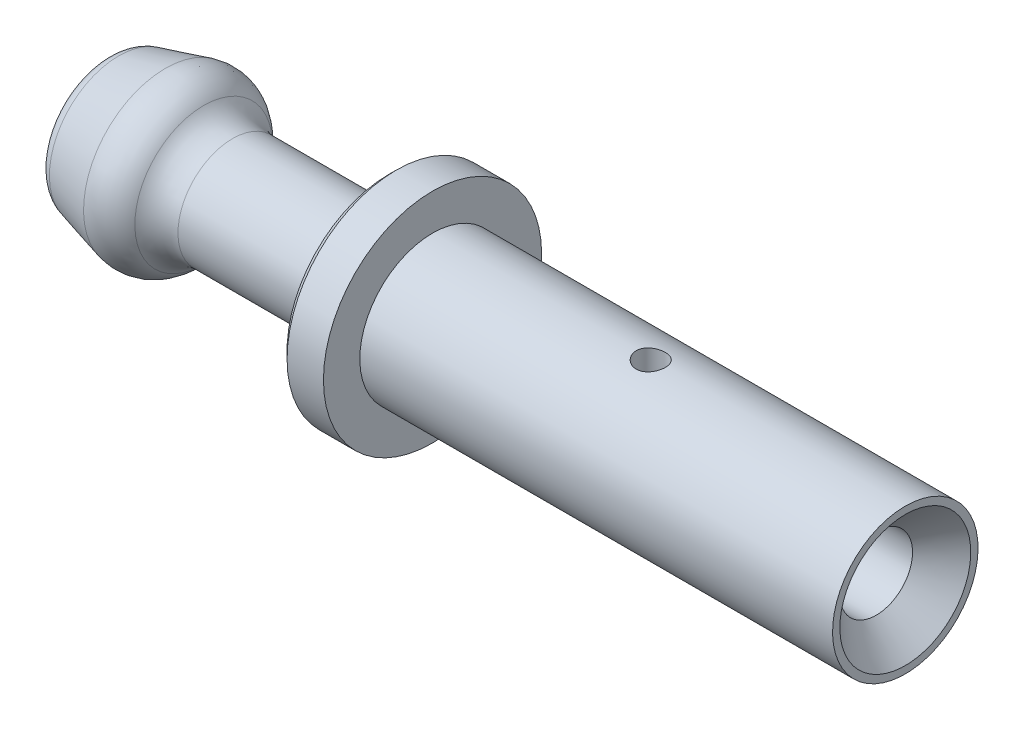
ISO-10303-21;
HEADER;
FILE_DESCRIPTION(('STEP AP214'),'2;1');
FILE_NAME('part.step','',(''),(''),'','','');
FILE_SCHEMA(('AUTOMOTIVE_DESIGN { 1 0 10303 214 1 1 1 1 }'));
ENDSEC;
DATA;
#1=APPLICATION_CONTEXT('core data for automotive mechanical design processes');
#2=APPLICATION_PROTOCOL_DEFINITION('international standard','automotive_design',2000,#1);
#3=PRODUCT_CONTEXT('',#1,'mechanical');
#4=PRODUCT('Part','Part','',(#3));
#5=PRODUCT_RELATED_PRODUCT_CATEGORY('part','',(#4));
#6=PRODUCT_DEFINITION_FORMATION('','',#4);
#7=PRODUCT_DEFINITION_CONTEXT('part definition',#1,'design');
#8=PRODUCT_DEFINITION('design','',#6,#7);
#9=PRODUCT_DEFINITION_SHAPE('','',#8);
#10=(LENGTH_UNIT() NAMED_UNIT(*) SI_UNIT(.MILLI.,.METRE.));
#11=(NAMED_UNIT(*) PLANE_ANGLE_UNIT() SI_UNIT($,.RADIAN.));
#12=(NAMED_UNIT(*) SI_UNIT($,.STERADIAN.) SOLID_ANGLE_UNIT());
#13=UNCERTAINTY_MEASURE_WITH_UNIT(LENGTH_MEASURE(1.E-05),#10,'distance_accuracy_value','');
#14=(GEOMETRIC_REPRESENTATION_CONTEXT(3) GLOBAL_UNCERTAINTY_ASSIGNED_CONTEXT((#13)) GLOBAL_UNIT_ASSIGNED_CONTEXT((#10,
#11,#12)) REPRESENTATION_CONTEXT('',''));
#15=CARTESIAN_POINT('',(0.,0.,0.));
#16=DIRECTION('',(0.,0.,1.));
#17=DIRECTION('',(1.,0.,0.));
#18=AXIS2_PLACEMENT_3D('',#15,#16,#17);
#19=CARTESIAN_POINT('',(0.,0.,0.));
#20=DIRECTION('',(1.,0.,0.));
#21=DIRECTION('',(0.,1.,0.));
#22=AXIS2_PLACEMENT_3D('',#19,#20,#21);
#23=CYLINDRICAL_SURFACE('',#22,1.);
#24=CARTESIAN_POINT('',(-7.71132486540519,0.,0.));
#25=DIRECTION('',(1.,0.,0.));
#26=DIRECTION('',(0.,1.,0.));
#27=AXIS2_PLACEMENT_3D('',#24,#25,#26);
#28=CIRCLE('',#27,1.);
#29=CARTESIAN_POINT('',(-7.71132486540519,0.999999999999999,0.));
#30=VERTEX_POINT('',#29);
#31=EDGE_CURVE('E47',#30,#30,#28,.T.);
#32=ORIENTED_EDGE('',*,*,#31,.F.);
#33=EDGE_LOOP('',(#32));
#34=FACE_BOUND('',#33,.T.);
#35=CARTESIAN_POINT('',(-0.799999999999989,0.,0.));
#36=DIRECTION('',(1.,0.,0.));
#37=DIRECTION('',(0.,1.,0.));
#38=AXIS2_PLACEMENT_3D('',#35,#36,#37);
#39=CIRCLE('',#38,1.);
#40=CARTESIAN_POINT('',(-0.799999999999989,1.,0.));
#41=VERTEX_POINT('',#40);
#42=EDGE_CURVE('E43',#41,#41,#39,.T.);
#43=ORIENTED_EDGE('',*,*,#42,.T.);
#44=EDGE_LOOP('',(#43));
#45=FACE_BOUND('',#44,.T.);
#46=CARTESIAN_POINT('',(-7.4,0.999999999999999,0.));
#47=CARTESIAN_POINT('',(-7.39999802963526,0.999998542454169,0.0214986010885783));
#48=CARTESIAN_POINT('',(-7.39825644958233,0.999298588613865,0.0430345128181348));
#49=CARTESIAN_POINT('',(-7.39135045929575,0.996566906201282,0.0854992960835793));
#50=CARTESIAN_POINT('',(-7.38617674418277,0.994531557397753,0.10642635551225));
#51=CARTESIAN_POINT('',(-7.37262478438823,0.989348418426236,0.146990784545481));
#52=CARTESIAN_POINT('',(-7.36425703075665,0.986204272728143,0.166632132323392));
#53=CARTESIAN_POINT('',(-7.34459616533469,0.979113221592155,0.204214394065674));
#54=CARTESIAN_POINT('',(-7.33330406901622,0.975166594916112,0.222155895350199));
#55=CARTESIAN_POINT('',(-7.30755290028781,0.966661772340836,0.256700201514079));
#56=CARTESIAN_POINT('',(-7.29297866875195,0.96208459385838,0.273212454510043));
#57=CARTESIAN_POINT('',(-7.26131999930464,0.952921153812388,0.303635000956944));
#58=CARTESIAN_POINT('',(-7.24423434055765,0.948334888907584,0.317544021426707));
#59=CARTESIAN_POINT('',(-7.20711438595155,0.939445583594272,0.342974913458576));
#60=CARTESIAN_POINT('',(-7.18698270279536,0.935164231929902,0.354362996239095));
#61=CARTESIAN_POINT('',(-7.14489272031599,0.927667294373584,0.37355094380743));
#62=CARTESIAN_POINT('',(-7.12293529443033,0.924451202488351,0.381352512857167));
#63=CARTESIAN_POINT('',(-7.07885753328158,0.919652715321636,0.392779764679174));
#64=CARTESIAN_POINT('',(-7.05678975288476,0.918002840711209,0.39657879316113));
#65=CARTESIAN_POINT('',(-7.01227300033855,0.916328008098287,0.400434592328006));
#66=CARTESIAN_POINT('',(-6.989824221075,0.916302251045536,0.400493203262645));
#67=CARTESIAN_POINT('',(-6.94684866570839,0.917821000559987,0.396997873500909));
#68=CARTESIAN_POINT('',(-6.92629685711819,0.919256350076899,0.393695062861028));
#69=CARTESIAN_POINT('',(-6.88606808879866,0.923352375215671,0.383989376059564));
#70=CARTESIAN_POINT('',(-6.86639128237794,0.926013264643345,0.377585958960927));
#71=CARTESIAN_POINT('',(-6.82799643276079,0.932318970177059,0.361738946510215));
#72=CARTESIAN_POINT('',(-6.80930615218906,0.935982758561574,0.352235972463064));
#73=CARTESIAN_POINT('',(-6.77371683672769,0.943876232779779,0.330501292146443));
#74=CARTESIAN_POINT('',(-6.75681847811944,0.948106130913696,0.318268561020169));
#75=CARTESIAN_POINT('',(-6.7239180542396,0.957053473484541,0.290310119890887));
#76=CARTESIAN_POINT('',(-6.7080862541108,0.961783329952302,0.274387492594128));
#77=CARTESIAN_POINT('',(-6.67926310439959,0.970919649916563,0.240062885486039));
#78=CARTESIAN_POINT('',(-6.66627232051794,0.975326048890648,0.221660413066887));
#79=CARTESIAN_POINT('',(-6.64327651051683,0.983429362529096,0.182415530521169));
#80=CARTESIAN_POINT('',(-6.63333554376059,0.98711054019083,0.161532098269295));
#81=CARTESIAN_POINT('',(-6.61716642778439,0.993229656657516,0.118204753096577));
#82=CARTESIAN_POINT('',(-6.61093639248852,0.995668226924759,0.0957616393699351));
#83=CARTESIAN_POINT('',(-6.60271034091606,0.998912279013825,0.0513791775215638));
#84=CARTESIAN_POINT('',(-6.60048550914929,0.999805891667044,0.0294886587971061));
#85=CARTESIAN_POINT('',(-6.59965737989427,1.00013695702124,-0.0143690619615625));
#86=CARTESIAN_POINT('',(-6.60105314369049,0.99957478716452,-0.0363362426447813));
#87=CARTESIAN_POINT('',(-6.6072583505104,0.997115134127565,-0.0786865478244008));
#88=CARTESIAN_POINT('',(-6.61191159607022,0.995278782691265,-0.0990964983551069));
#89=CARTESIAN_POINT('',(-6.62428714166194,0.99051888281078,-0.138827085612144));
#90=CARTESIAN_POINT('',(-6.63200983593365,0.987595194712245,-0.158147582044925));
#91=CARTESIAN_POINT('',(-6.65055698793608,0.980833189542462,-0.195815757163386));
#92=CARTESIAN_POINT('',(-6.66146909440896,0.976969631962783,-0.214115604551254));
#93=CARTESIAN_POINT('',(-6.68598806478079,0.96874672948787,-0.248688718249139));
#94=CARTESIAN_POINT('',(-6.69959600858327,0.964387186208664,-0.264961168151581));
#95=CARTESIAN_POINT('',(-6.73017400259126,0.955290235288882,-0.296144608606451));
#96=CARTESIAN_POINT('',(-6.74730670830639,0.950546882898802,-0.310894786763855));
#97=CARTESIAN_POINT('',(-6.78388801659673,0.941483345785557,-0.3373502394801));
#98=CARTESIAN_POINT('',(-6.80333700004875,0.937163230870841,-0.349055012257618));
#99=CARTESIAN_POINT('',(-6.84429233893345,0.929428600000267,-0.369161500393949));
#100=CARTESIAN_POINT('',(-6.86581679990525,0.926023262460851,-0.377530118940405));
#101=CARTESIAN_POINT('',(-6.91014673040877,0.920647347493311,-0.390459243974678));
#102=CARTESIAN_POINT('',(-6.93295124118302,0.918675711269999,-0.395022561061875));
#103=CARTESIAN_POINT('',(-6.97742558033081,0.91654351871331,-0.399943123447689));
#104=CARTESIAN_POINT('',(-6.99905896789162,0.916262842915928,-0.400579416460557));
#105=CARTESIAN_POINT('',(-7.04210897152816,0.917229673036891,-0.398360631859244));
#106=CARTESIAN_POINT('',(-7.06352561478152,0.918476984905473,-0.395505997582236));
#107=CARTESIAN_POINT('',(-7.10466643798003,0.922253297913189,-0.386614273229071));
#108=CARTESIAN_POINT('',(-7.12442405488902,0.924729663589159,-0.38070749871375));
#109=CARTESIAN_POINT('',(-7.16267572592027,0.930648002531149,-0.366001089698648));
#110=CARTESIAN_POINT('',(-7.1811694293793,0.934090242430089,-0.357200656278885));
#111=CARTESIAN_POINT('',(-7.21752192385486,0.94179721918987,-0.336374552551817));
#112=CARTESIAN_POINT('',(-7.23528373402629,0.94609776462135,-0.324193067031864));
#113=CARTESIAN_POINT('',(-7.26859866344056,0.954927608749607,-0.297178423854335));
#114=CARTESIAN_POINT('',(-7.28415111442561,0.959456976098228,-0.282344466963635));
#115=CARTESIAN_POINT('',(-7.31364057065278,0.96858713417328,-0.249301101254483));
#116=CARTESIAN_POINT('',(-7.32740746137963,0.973173515923966,-0.230935200229226));
#117=CARTESIAN_POINT('',(-7.35166740852431,0.981600813427836,-0.191980064057159));
#118=CARTESIAN_POINT('',(-7.3621589424305,0.985441382185918,-0.171389800909449));
#119=CARTESIAN_POINT('',(-7.37932444303806,0.991879429631616,-0.12894761249904));
#120=CARTESIAN_POINT('',(-7.38606586471207,0.994498726110027,-0.107126323643939));
#121=CARTESIAN_POINT('',(-7.39572782419085,0.998288612418758,-0.0625753092562444));
#122=CARTESIAN_POINT('',(-7.39866048734878,0.999463798991278,-0.0398487051717826));
#123=CARTESIAN_POINT('',(-7.39987907619566,0.999951799008271,-0.0113824595781859));
#124=CARTESIAN_POINT('',(-7.40000052172584,1.00000038593835,-0.00569253774815164));
#125=CARTESIAN_POINT('',(-7.4,0.999999999999999,0.));
#126=B_SPLINE_CURVE_WITH_KNOTS('',3,(#46,#47,#48,#49,#50,#51,#52,#53,#54,#55,#56,#57,#58,#59,
#60,#61,#62,#63,#64,#65,#66,#67,#68,#69,#70,#71,#72,#73,#74,#75,#76,#77,#78,#79,#80,#81,#82,#83,
#84,#85,#86,#87,#88,#89,#90,#91,#92,#93,#94,#95,#96,#97,#98,#99,#100,#101,#102,#103,#104,#105,
#106,#107,#108,#109,#110,#111,#112,#113,#114,#115,#116,#117,#118,#119,#120,#121,#122,#123,#124,
#125),.UNSPECIFIED.,.T.,.F.,(4,2,2,2,2,2,2,2,2,2,2,2,2,2,2,2,2,2,2,2,2,2,2,2,2,2,2,2,2,2,2,2,2,
2,2,2,2,2,2,4),(0.,0.0644805975786143,0.129136727201587,0.193582291494316,0.258005507135969,
0.325194763400794,0.392416789868823,0.462630517638434,0.532810846236537,0.599808210617656,
0.666772612680976,0.729076656802745,0.791391574512095,0.854978252597632,0.918588843876367,
0.987116698373114,1.05565818567947,1.12555382632561,1.19541391222758,1.26113836905602,
1.32684578714017,1.38960091112873,1.45236409798759,1.51704702679653,1.58175591899794,
1.65073694924883,1.7197293380875,1.7893900902654,1.85899934525669,1.92359934671756,
1.98819114502614,2.05022863699759,2.11228327151037,2.17789093601343,2.24351840259684,
2.31340084696772,2.38331572718112,2.45192860192669,2.52032250470874,2.53739609169364),.UNSPECIFIED.);
#127=CARTESIAN_POINT('',(-7.4,0.999999999999999,0.));
#128=VERTEX_POINT('',#127);
#129=EDGE_CURVE('E97',#128,#128,#126,.T.);
#130=ORIENTED_EDGE('',*,*,#129,.T.);
#131=EDGE_LOOP('',(#130));
#132=FACE_BOUND('',#131,.T.);
#133=ADVANCED_FACE('F31',(#34,#45,#132),#23,.F.);
#134=CARTESIAN_POINT('',(0.,0.,0.));
#135=DIRECTION('',(1.,0.,0.));
#136=DIRECTION('',(0.,1.,0.));
#137=AXIS2_PLACEMENT_3D('',#134,#135,#136);
#138=CYLINDRICAL_SURFACE('',#137,2.);
#139=CARTESIAN_POINT('',(0.,0.,0.));
#140=DIRECTION('',(1.,0.,0.));
#141=DIRECTION('',(0.,1.,0.));
#142=AXIS2_PLACEMENT_3D('',#139,#140,#141);
#143=CIRCLE('',#142,2.);
#144=CARTESIAN_POINT('',(0.,2.,0.));
#145=VERTEX_POINT('',#144);
#146=EDGE_CURVE('E94',#145,#145,#143,.T.);
#147=ORIENTED_EDGE('',*,*,#146,.F.);
#148=EDGE_LOOP('',(#147));
#149=FACE_BOUND('',#148,.T.);
#150=CARTESIAN_POINT('',(-13.,0.,0.));
#151=DIRECTION('',(1.,0.,0.));
#152=DIRECTION('',(0.,1.,0.));
#153=AXIS2_PLACEMENT_3D('',#150,#151,#152);
#154=CIRCLE('',#153,2.);
#155=CARTESIAN_POINT('',(-13.,2.,0.));
#156=VERTEX_POINT('',#155);
#157=EDGE_CURVE('E91',#156,#156,#154,.T.);
#158=ORIENTED_EDGE('',*,*,#157,.T.);
#159=EDGE_LOOP('',(#158));
#160=FACE_BOUND('',#159,.T.);
#161=CARTESIAN_POINT('',(-7.4,2.,0.));
#162=CARTESIAN_POINT('',(-7.39999918220066,1.99999959032348,-0.0222307627170533));
#163=CARTESIAN_POINT('',(-7.39814046281294,1.99962554071292,-0.0444718640806091));
#164=CARTESIAN_POINT('',(-7.3907605999539,1.99816946249293,-0.0883254030756079));
#165=CARTESIAN_POINT('',(-7.3852365468794,1.99708687144074,-0.109937327016543));
#166=CARTESIAN_POINT('',(-7.37070349055168,1.99433459711315,-0.151892122105325));
#167=CARTESIAN_POINT('',(-7.36169782526213,1.99266547630687,-0.172236187173254));
#168=CARTESIAN_POINT('',(-7.34046710099548,1.98892159214126,-0.211123195545691));
#169=CARTESIAN_POINT('',(-7.32824223375712,1.98684685294283,-0.229666246030325));
#170=CARTESIAN_POINT('',(-7.30074460228343,1.98248866131988,-0.264677390925946));
#171=CARTESIAN_POINT('',(-7.28543665784352,1.98020298201739,-0.28111758046341));
#172=CARTESIAN_POINT('',(-7.25228303344332,1.97569672181035,-0.311214702643212));
#173=CARTESIAN_POINT('',(-7.23443715546595,1.9734761460017,-0.32487141790817));
#174=CARTESIAN_POINT('',(-7.19651352279525,1.96932976725046,-0.349132701339048));
#175=CARTESIAN_POINT('',(-7.17641694248146,1.96740682945978,-0.359708375546347));
#176=CARTESIAN_POINT('',(-7.13468727239837,1.96410507223367,-0.377322266632123));
#177=CARTESIAN_POINT('',(-7.11305433466146,1.96272619904785,-0.384360832974895));
#178=CARTESIAN_POINT('',(-7.06916625443683,1.96069122100882,-0.394610119953931));
#179=CARTESIAN_POINT('',(-7.04692298234311,1.96002588042875,-0.397869799183511));
#180=CARTESIAN_POINT('',(-7.00219607145426,1.95946550024251,-0.400620851090448));
#181=CARTESIAN_POINT('',(-6.97971245747194,1.95957038187136,-0.4001126090854));
#182=CARTESIAN_POINT('',(-6.9355012847916,1.96053020459274,-0.395381829240728));
#183=CARTESIAN_POINT('',(-6.91376743774907,1.96137381143505,-0.391215416097563));
#184=CARTESIAN_POINT('',(-6.8713135693348,1.96369818464001,-0.37937515384922));
#185=CARTESIAN_POINT('',(-6.8505935964324,1.96517898143111,-0.371701137240272));
#186=CARTESIAN_POINT('',(-6.81059389531856,1.96862247400163,-0.353009913469888));
#187=CARTESIAN_POINT('',(-6.79132484817233,1.97058835925482,-0.341970460492846));
#188=CARTESIAN_POINT('',(-6.75489166001087,1.97477847509225,-0.316877429829072));
#189=CARTESIAN_POINT('',(-6.73772776125954,1.97700273535346,-0.302823505742731));
#190=CARTESIAN_POINT('',(-6.70566823901723,1.98150808496585,-0.271799973824234));
#191=CARTESIAN_POINT('',(-6.69081897285635,1.98378947684362,-0.254782464484978));
#192=CARTESIAN_POINT('',(-6.66417846147951,1.98811539485763,-0.218474009624805));
#193=CARTESIAN_POINT('',(-6.65238725548257,1.99015991795589,-0.199183034951756));
#194=CARTESIAN_POINT('',(-6.63218899630961,1.99378676064355,-0.158823754751568));
#195=CARTESIAN_POINT('',(-6.62378724254218,1.99536835539309,-0.13775272783412));
#196=CARTESIAN_POINT('',(-6.61065581038457,1.99788563595143,-0.0944595905794659));
#197=CARTESIAN_POINT('',(-6.60592568717055,1.99882140000213,-0.0722376200289798));
#198=CARTESIAN_POINT('',(-6.60033741848229,1.99993068746747,-0.0276717622508601));
#199=CARTESIAN_POINT('',(-6.59941583218389,2.00011669860988,-0.00533613133023031));
#200=CARTESIAN_POINT('',(-6.60129994357687,1.99974020772041,0.0391699736770859));
#201=CARTESIAN_POINT('',(-6.60410543174104,1.99917774776578,0.0613404569775176));
#202=CARTESIAN_POINT('',(-6.61331134941758,1.99737532803207,0.104682263978617));
#203=CARTESIAN_POINT('',(-6.61967922739916,1.99614150561683,0.125860779335962));
#204=CARTESIAN_POINT('',(-6.63579359306232,1.99313420824413,0.166849450999867));
#205=CARTESIAN_POINT('',(-6.64554033387073,1.99136069285691,0.186659504655016));
#206=CARTESIAN_POINT('',(-6.66827299626052,1.98743964613318,0.224616469474487));
#207=CARTESIAN_POINT('',(-6.68129711241558,1.98528780174821,0.242740050700875));
#208=CARTESIAN_POINT('',(-6.71016367648291,1.98085893931953,0.276567207647683));
#209=CARTESIAN_POINT('',(-6.72600642655995,1.97858190787355,0.292270523572305));
#210=CARTESIAN_POINT('',(-6.76034934075645,1.97411721422786,0.321056236309671));
#211=CARTESIAN_POINT('',(-6.77888629768853,1.97193144093322,0.334095080979462));
#212=CARTESIAN_POINT('',(-6.81792454454267,1.96793676718478,0.356874168020483));
#213=CARTESIAN_POINT('',(-6.83842575582942,1.96612785165337,0.366614542369162));
#214=CARTESIAN_POINT('',(-6.88070729845982,1.96310696233753,0.382460736632785));
#215=CARTESIAN_POINT('',(-6.90248033648413,1.96189189948875,0.388585399916421));
#216=CARTESIAN_POINT('',(-6.94677338139636,1.9601897471681,0.397083460650879));
#217=CARTESIAN_POINT('',(-6.96929329048374,1.95970256276445,0.399457347290045));
#218=CARTESIAN_POINT('',(-7.01400354581773,1.95951659852552,0.400368364346988));
#219=CARTESIAN_POINT('',(-7.0361924595708,1.9598036767572,0.398974315228359));
#220=CARTESIAN_POINT('',(-7.08001265996201,1.96110229393845,0.392540921640025));
#221=CARTESIAN_POINT('',(-7.10164395107792,1.96211382706868,0.38750160645172));
#222=CARTESIAN_POINT('',(-7.14369108449622,1.96474105687663,0.373951427399582));
#223=CARTESIAN_POINT('',(-7.16410974420097,1.96635528407532,0.365449002686938));
#224=CARTESIAN_POINT('',(-7.20324148829378,1.97000685989668,0.345221857840642));
#225=CARTESIAN_POINT('',(-7.22195442949006,1.97204424399558,0.333496867509953));
#226=CARTESIAN_POINT('',(-7.25748622886013,1.9763558420929,0.306922365914566));
#227=CARTESIAN_POINT('',(-7.27426750610704,1.9786334916388,0.292023154894073));
#228=CARTESIAN_POINT('',(-7.30511448221167,1.98314432748782,0.259625747605257));
#229=CARTESIAN_POINT('',(-7.31917955612691,1.98537750345274,0.242126954861335));
#230=CARTESIAN_POINT('',(-7.34433385757858,1.98957532955189,0.204807051635299));
#231=CARTESIAN_POINT('',(-7.35539040131201,1.99153692487698,0.184963553771934));
#232=CARTESIAN_POINT('',(-7.37399444903864,1.99494050034,0.143666544376294));
#233=CARTESIAN_POINT('',(-7.381545115813,1.99638294855446,0.122214504345251));
#234=CARTESIAN_POINT('',(-7.39146077921789,1.99830549038148,0.0839285955695119));
#235=CARTESIAN_POINT('',(-7.3946572774831,1.99893721263381,0.067312665605514));
#236=CARTESIAN_POINT('',(-7.39892716494335,1.99978461655957,0.0337998100840269));
#237=CARTESIAN_POINT('',(-7.40000062180391,2.00000031149262,0.0169028934994477));
#238=CARTESIAN_POINT('',(-7.4,2.,0.));
#239=B_SPLINE_CURVE_WITH_KNOTS('',3,(#161,#162,#163,#164,#165,#166,#167,#168,#169,#170,#171,
#172,#173,#174,#175,#176,#177,#178,#179,#180,#181,#182,#183,#184,#185,#186,#187,#188,#189,#190,
#191,#192,#193,#194,#195,#196,#197,#198,#199,#200,#201,#202,#203,#204,#205,#206,#207,#208,#209,
#210,#211,#212,#213,#214,#215,#216,#217,#218,#219,#220,#221,#222,#223,#224,#225,#226,#227,#228,
#229,#230,#231,#232,#233,#234,#235,#236,#237,#238),.UNSPECIFIED.,.T.,.F.,(4,2,2,2,2,2,2,2,2,2,2,
2,2,2,2,2,2,2,2,2,2,2,2,2,2,2,2,2,2,2,2,2,2,2,2,2,2,2,4),(0.,0.0666304522645035,
0.133313860276529,0.199933494100137,0.266549160892346,0.333973068044875,0.401402238698947,
0.469444780023691,0.53748059746079,0.604624740414349,0.671762017124901,0.737886908025114,
0.80401495701492,0.870589960814371,0.937172618998683,1.0049530099654,1.07273427015928,
1.1406210994161,1.20849970279215,1.27524294270506,1.34198243063147,1.4081218158029,
1.47426615686409,1.54122026413344,1.60818155338372,1.6761625143169,1.74414075489387,
1.8117615241309,1.87937347332166,1.94575889027081,2.01214377397044,2.07836784501244,
2.14459747032747,2.21195230495657,2.27932261813172,2.34739798670255,2.41541182207008,
2.46607510115958,2.51673676548399),.UNSPECIFIED.);
#240=CARTESIAN_POINT('',(-7.4,2.,0.));
#241=VERTEX_POINT('',#240);
#242=EDGE_CURVE('E35',#241,#241,#239,.T.);
#243=ORIENTED_EDGE('',*,*,#242,.T.);
#244=EDGE_LOOP('',(#243));
#245=FACE_BOUND('',#244,.T.);
#246=ADVANCED_FACE('F109',(#149,#160,#245),#138,.T.);
#247=CARTESIAN_POINT('',(0.,2.,0.));
#248=DIRECTION('',(1.,0.,0.));
#249=DIRECTION('',(0.,1.,0.));
#250=AXIS2_PLACEMENT_3D('',#247,#248,#249);
#251=PLANE('',#250);
#252=ORIENTED_EDGE('',*,*,#146,.T.);
#253=EDGE_LOOP('',(#252));
#254=FACE_BOUND('',#253,.T.);
#255=CARTESIAN_POINT('',(0.,0.,0.));
#256=DIRECTION('',(1.,0.,0.));
#257=DIRECTION('',(0.,1.,0.));
#258=AXIS2_PLACEMENT_3D('',#255,#256,#257);
#259=CIRCLE('',#258,1.8);
#260=CARTESIAN_POINT('',(0.,1.8,0.));
#261=VERTEX_POINT('',#260);
#262=EDGE_CURVE('E10',#261,#261,#259,.T.);
#263=ORIENTED_EDGE('',*,*,#262,.F.);
#264=EDGE_LOOP('',(#263));
#265=FACE_BOUND('',#264,.T.);
#266=ADVANCED_FACE('F33',(#254,#265),#251,.T.);
#267=CARTESIAN_POINT('',(-0.799999999999989,0.,0.));
#268=DIRECTION('',(1.,0.,0.));
#269=DIRECTION('',(0.,1.,0.));
#270=AXIS2_PLACEMENT_3D('',#267,#268,#269);
#271=CONICAL_SURFACE('',#270,1.,0.785398163397455);
#272=ORIENTED_EDGE('',*,*,#262,.T.);
#273=EDGE_LOOP('',(#272));
#274=FACE_BOUND('',#273,.T.);
#275=ORIENTED_EDGE('',*,*,#42,.F.);
#276=EDGE_LOOP('',(#275));
#277=FACE_BOUND('',#276,.T.);
#278=ADVANCED_FACE('F167',(#274,#277),#271,.F.);
#279=CARTESIAN_POINT('',(-8.,0.,0.));
#280=DIRECTION('',(1.,0.,0.));
#281=DIRECTION('',(0.,1.,0.));
#282=AXIS2_PLACEMENT_3D('',#279,#280,#281);
#283=CONICAL_SURFACE('',#282,0.5,1.0471975511966);
#284=ORIENTED_EDGE('',*,*,#31,.T.);
#285=EDGE_LOOP('',(#284));
#286=FACE_BOUND('',#285,.T.);
#287=CARTESIAN_POINT('',(-8.,0.,0.));
#288=DIRECTION('',(1.,0.,0.));
#289=DIRECTION('',(0.,1.,0.));
#290=AXIS2_PLACEMENT_3D('',#287,#288,#289);
#291=CIRCLE('',#290,0.5);
#292=CARTESIAN_POINT('',(-8.,0.499999999999999,0.));
#293=VERTEX_POINT('',#292);
#294=EDGE_CURVE('E52',#293,#293,#291,.T.);
#295=ORIENTED_EDGE('',*,*,#294,.F.);
#296=EDGE_LOOP('',(#295));
#297=FACE_BOUND('',#296,.T.);
#298=ADVANCED_FACE('F164',(#286,#297),#283,.F.);
#299=CARTESIAN_POINT('',(0.,0.,0.));
#300=DIRECTION('',(1.,0.,0.));
#301=DIRECTION('',(0.,1.,0.));
#302=AXIS2_PLACEMENT_3D('',#299,#300,#301);
#303=CYLINDRICAL_SURFACE('',#302,0.500000000000001);
#304=ORIENTED_EDGE('',*,*,#294,.T.);
#305=EDGE_LOOP('',(#304));
#306=FACE_BOUND('',#305,.T.);
#307=CARTESIAN_POINT('',(-21.5,0.,0.));
#308=DIRECTION('',(1.,0.,0.));
#309=DIRECTION('',(0.,1.,0.));
#310=AXIS2_PLACEMENT_3D('',#307,#308,#309);
#311=CIRCLE('',#310,0.500000000000003);
#312=CARTESIAN_POINT('',(-21.5,0.500000000000001,0.));
#313=VERTEX_POINT('',#312);
#314=EDGE_CURVE('E55',#313,#313,#311,.T.);
#315=ORIENTED_EDGE('',*,*,#314,.F.);
#316=EDGE_LOOP('',(#315));
#317=FACE_BOUND('',#316,.T.);
#318=ADVANCED_FACE('F161',(#306,#317),#303,.F.);
#319=CARTESIAN_POINT('',(-22.,0.,0.));
#320=DIRECTION('',(-1.,0.,0.));
#321=DIRECTION('',(0.,-1.,0.));
#322=AXIS2_PLACEMENT_3D('',#319,#320,#321);
#323=CONICAL_SURFACE('',#322,1.,0.785398163397452);
#324=ORIENTED_EDGE('',*,*,#314,.T.);
#325=EDGE_LOOP('',(#324));
#326=FACE_BOUND('',#325,.T.);
#327=CARTESIAN_POINT('',(-22.,0.,0.));
#328=DIRECTION('',(1.,0.,0.));
#329=DIRECTION('',(0.,1.,0.));
#330=AXIS2_PLACEMENT_3D('',#327,#328,#329);
#331=CIRCLE('',#330,1.);
#332=CARTESIAN_POINT('',(-22.,0.999999999999997,0.));
#333=VERTEX_POINT('',#332);
#334=EDGE_CURVE('E58',#333,#333,#331,.T.);
#335=ORIENTED_EDGE('',*,*,#334,.F.);
#336=EDGE_LOOP('',(#335));
#337=FACE_BOUND('',#336,.T.);
#338=ADVANCED_FACE('F157',(#326,#337),#323,.F.);
#339=CARTESIAN_POINT('',(-22.,0.999999999999997,0.));
#340=DIRECTION('',(-1.,0.,0.));
#341=DIRECTION('',(0.,-1.,0.));
#342=AXIS2_PLACEMENT_3D('',#339,#340,#341);
#343=PLANE('',#342);
#344=ORIENTED_EDGE('',*,*,#334,.T.);
#345=EDGE_LOOP('',(#344));
#346=FACE_BOUND('',#345,.T.);
#347=CARTESIAN_POINT('',(-22.,0.,0.));
#348=DIRECTION('',(1.,0.,0.));
#349=DIRECTION('',(0.,1.,0.));
#350=AXIS2_PLACEMENT_3D('',#347,#348,#349);
#351=CIRCLE('',#350,1.42334947556564);
#352=CARTESIAN_POINT('',(-22.,1.42334947556564,0.));
#353=VERTEX_POINT('',#352);
#354=EDGE_CURVE('E61',#353,#353,#351,.T.);
#355=ORIENTED_EDGE('',*,*,#354,.F.);
#356=EDGE_LOOP('',(#355));
#357=FACE_BOUND('',#356,.T.);
#358=ADVANCED_FACE('F153',(#346,#357),#343,.T.);
#359=CARTESIAN_POINT('',(-21.5,0.,0.));
#360=DIRECTION('',(1.,0.,0.));
#361=DIRECTION('',(0.,1.,0.));
#362=AXIS2_PLACEMENT_3D('',#359,#360,#361);
#363=TOROIDAL_SURFACE('',#362,1.42334947556564,0.5);
#364=ORIENTED_EDGE('',*,*,#354,.T.);
#365=EDGE_LOOP('',(#364));
#366=FACE_BOUND('',#365,.T.);
#367=CARTESIAN_POINT('',(-21.6294095225513,0.,0.));
#368=DIRECTION('',(1.,0.,0.));
#369=DIRECTION('',(0.,1.,0.));
#370=AXIS2_PLACEMENT_3D('',#367,#368,#369);
#371=CIRCLE('',#370,1.90631238871018);
#372=CARTESIAN_POINT('',(-21.6294095225513,1.90631238871017,0.));
#373=VERTEX_POINT('',#372);
#374=EDGE_CURVE('E64',#373,#373,#371,.T.);
#375=ORIENTED_EDGE('',*,*,#374,.F.);
#376=EDGE_LOOP('',(#375));
#377=FACE_BOUND('',#376,.T.);
#378=ADVANCED_FACE('F149',(#366,#377),#363,.T.);
#379=CARTESIAN_POINT('',(-20.3467498952856,0.,0.));
#380=DIRECTION('',(1.,0.,0.));
#381=DIRECTION('',(0.,1.,0.));
#382=AXIS2_PLACEMENT_3D('',#379,#380,#381);
#383=CONICAL_SURFACE('',#382,2.25,0.261799387799143);
#384=ORIENTED_EDGE('',*,*,#374,.T.);
#385=EDGE_LOOP('',(#384));
#386=FACE_BOUND('',#385,.T.);
#387=CARTESIAN_POINT('',(-20.3467498952856,0.,0.));
#388=DIRECTION('',(1.,0.,0.));
#389=DIRECTION('',(0.,1.,0.));
#390=AXIS2_PLACEMENT_3D('',#387,#388,#389);
#391=CIRCLE('',#390,2.25);
#392=CARTESIAN_POINT('',(-20.3467498952856,2.25,0.));
#393=VERTEX_POINT('',#392);
#394=EDGE_CURVE('E67',#393,#393,#391,.T.);
#395=ORIENTED_EDGE('',*,*,#394,.F.);
#396=EDGE_LOOP('',(#395));
#397=FACE_BOUND('',#396,.T.);
#398=ADVANCED_FACE('F145',(#386,#397),#383,.T.);
#399=CARTESIAN_POINT('',(-20.0879308501831,0.,0.));
#400=DIRECTION('',(1.,0.,0.));
#401=DIRECTION('',(0.,1.,0.));
#402=AXIS2_PLACEMENT_3D('',#399,#400,#401);
#403=TOROIDAL_SURFACE('',#402,1.28407417371093,1.);
#404=ORIENTED_EDGE('',*,*,#394,.T.);
#405=EDGE_LOOP('',(#404));
#406=FACE_BOUND('',#405,.T.);
#407=CARTESIAN_POINT('',(-19.2939654250915,0.,0.));
#408=DIRECTION('',(1.,0.,0.));
#409=DIRECTION('',(0.,1.,0.));
#410=AXIS2_PLACEMENT_3D('',#407,#408,#409);
#411=CIRCLE('',#410,1.89203708685547);
#412=CARTESIAN_POINT('',(-19.2939654250915,1.89203708685546,0.));
#413=VERTEX_POINT('',#412);
#414=EDGE_CURVE('E70',#413,#413,#411,.T.);
#415=ORIENTED_EDGE('',*,*,#414,.F.);
#416=EDGE_LOOP('',(#415));
#417=FACE_BOUND('',#416,.T.);
#418=ADVANCED_FACE('F141',(#406,#417),#403,.T.);
#419=CARTESIAN_POINT('',(-18.5,0.,0.));
#420=DIRECTION('',(1.,0.,0.));
#421=DIRECTION('',(0.,1.,0.));
#422=AXIS2_PLACEMENT_3D('',#419,#420,#421);
#423=TOROIDAL_SURFACE('',#422,2.5,0.999999999999999);
#424=ORIENTED_EDGE('',*,*,#414,.T.);
#425=EDGE_LOOP('',(#424));
#426=FACE_BOUND('',#425,.T.);
#427=CARTESIAN_POINT('',(-18.5,0.,0.));
#428=DIRECTION('',(1.,0.,0.));
#429=DIRECTION('',(0.,1.,0.));
#430=AXIS2_PLACEMENT_3D('',#427,#428,#429);
#431=CIRCLE('',#430,1.5);
#432=CARTESIAN_POINT('',(-18.5,1.5,0.));
#433=VERTEX_POINT('',#432);
#434=EDGE_CURVE('E73',#433,#433,#431,.T.);
#435=ORIENTED_EDGE('',*,*,#434,.F.);
#436=EDGE_LOOP('',(#435));
#437=FACE_BOUND('',#436,.T.);
#438=ADVANCED_FACE('F137',(#426,#437),#423,.F.);
#439=CARTESIAN_POINT('',(0.,0.,0.));
#440=DIRECTION('',(1.,0.,0.));
#441=DIRECTION('',(0.,1.,0.));
#442=AXIS2_PLACEMENT_3D('',#439,#440,#441);
#443=CYLINDRICAL_SURFACE('',#442,1.5);
#444=ORIENTED_EDGE('',*,*,#434,.T.);
#445=EDGE_LOOP('',(#444));
#446=FACE_BOUND('',#445,.T.);
#447=CARTESIAN_POINT('',(-15.,0.,0.));
#448=DIRECTION('',(1.,0.,0.));
#449=DIRECTION('',(0.,1.,0.));
#450=AXIS2_PLACEMENT_3D('',#447,#448,#449);
#451=CIRCLE('',#450,1.5);
#452=CARTESIAN_POINT('',(-15.,1.5,0.));
#453=VERTEX_POINT('',#452);
#454=EDGE_CURVE('E76',#453,#453,#451,.T.);
#455=ORIENTED_EDGE('',*,*,#454,.F.);
#456=EDGE_LOOP('',(#455));
#457=FACE_BOUND('',#456,.T.);
#458=ADVANCED_FACE('F133',(#446,#457),#443,.T.);
#459=CARTESIAN_POINT('',(-15.,0.,0.));
#460=DIRECTION('',(1.,0.,0.));
#461=DIRECTION('',(0.,1.,0.));
#462=AXIS2_PLACEMENT_3D('',#459,#460,#461);
#463=TOROIDAL_SURFACE('',#462,2.3,0.8);
#464=ORIENTED_EDGE('',*,*,#454,.T.);
#465=EDGE_LOOP('',(#464));
#466=FACE_BOUND('',#465,.T.);
#467=CARTESIAN_POINT('',(-14.2,0.,0.));
#468=DIRECTION('',(1.,0.,0.));
#469=DIRECTION('',(0.,1.,0.));
#470=AXIS2_PLACEMENT_3D('',#467,#468,#469);
#471=CIRCLE('',#470,2.3);
#472=CARTESIAN_POINT('',(-14.2,2.3,0.));
#473=VERTEX_POINT('',#472);
#474=EDGE_CURVE('E79',#473,#473,#471,.T.);
#475=ORIENTED_EDGE('',*,*,#474,.F.);
#476=EDGE_LOOP('',(#475));
#477=FACE_BOUND('',#476,.T.);
#478=ADVANCED_FACE('F129',(#466,#477),#463,.F.);
#479=CARTESIAN_POINT('',(-14.2,2.3,0.));
#480=DIRECTION('',(-1.,0.,0.));
#481=DIRECTION('',(0.,-1.,0.));
#482=AXIS2_PLACEMENT_3D('',#479,#480,#481);
#483=PLANE('',#482);
#484=ORIENTED_EDGE('',*,*,#474,.T.);
#485=EDGE_LOOP('',(#484));
#486=FACE_BOUND('',#485,.T.);
#487=CARTESIAN_POINT('',(-14.2,0.,0.));
#488=DIRECTION('',(1.,0.,0.));
#489=DIRECTION('',(0.,1.,0.));
#490=AXIS2_PLACEMENT_3D('',#487,#488,#489);
#491=CIRCLE('',#490,2.8);
#492=CARTESIAN_POINT('',(-14.2,2.8,0.));
#493=VERTEX_POINT('',#492);
#494=EDGE_CURVE('E82',#493,#493,#491,.T.);
#495=ORIENTED_EDGE('',*,*,#494,.F.);
#496=EDGE_LOOP('',(#495));
#497=FACE_BOUND('',#496,.T.);
#498=ADVANCED_FACE('F125',(#486,#497),#483,.T.);
#499=CARTESIAN_POINT('',(-14.,0.,0.));
#500=DIRECTION('',(1.,0.,0.));
#501=DIRECTION('',(0.,1.,0.));
#502=AXIS2_PLACEMENT_3D('',#499,#500,#501);
#503=CONICAL_SURFACE('',#502,3.,0.785398163397466);
#504=ORIENTED_EDGE('',*,*,#494,.T.);
#505=EDGE_LOOP('',(#504));
#506=FACE_BOUND('',#505,.T.);
#507=CARTESIAN_POINT('',(-14.,0.,0.));
#508=DIRECTION('',(1.,0.,0.));
#509=DIRECTION('',(0.,1.,0.));
#510=AXIS2_PLACEMENT_3D('',#507,#508,#509);
#511=CIRCLE('',#510,3.);
#512=CARTESIAN_POINT('',(-14.,3.,0.));
#513=VERTEX_POINT('',#512);
#514=EDGE_CURVE('E85',#513,#513,#511,.T.);
#515=ORIENTED_EDGE('',*,*,#514,.F.);
#516=EDGE_LOOP('',(#515));
#517=FACE_BOUND('',#516,.T.);
#518=ADVANCED_FACE('F121',(#506,#517),#503,.T.);
#519=CARTESIAN_POINT('',(0.,0.,0.));
#520=DIRECTION('',(1.,0.,0.));
#521=DIRECTION('',(0.,1.,0.));
#522=AXIS2_PLACEMENT_3D('',#519,#520,#521);
#523=CYLINDRICAL_SURFACE('',#522,3.);
#524=ORIENTED_EDGE('',*,*,#514,.T.);
#525=EDGE_LOOP('',(#524));
#526=FACE_BOUND('',#525,.T.);
#527=CARTESIAN_POINT('',(-13.,0.,0.));
#528=DIRECTION('',(1.,0.,0.));
#529=DIRECTION('',(0.,1.,0.));
#530=AXIS2_PLACEMENT_3D('',#527,#528,#529);
#531=CIRCLE('',#530,3.);
#532=CARTESIAN_POINT('',(-13.,3.,0.));
#533=VERTEX_POINT('',#532);
#534=EDGE_CURVE('E88',#533,#533,#531,.T.);
#535=ORIENTED_EDGE('',*,*,#534,.F.);
#536=EDGE_LOOP('',(#535));
#537=FACE_BOUND('',#536,.T.);
#538=ADVANCED_FACE('F117',(#526,#537),#523,.T.);
#539=CARTESIAN_POINT('',(-13.,3.,0.));
#540=DIRECTION('',(1.,0.,0.));
#541=DIRECTION('',(0.,1.,0.));
#542=AXIS2_PLACEMENT_3D('',#539,#540,#541);
#543=PLANE('',#542);
#544=ORIENTED_EDGE('',*,*,#534,.T.);
#545=EDGE_LOOP('',(#544));
#546=FACE_BOUND('',#545,.T.);
#547=ORIENTED_EDGE('',*,*,#157,.F.);
#548=EDGE_LOOP('',(#547));
#549=FACE_BOUND('',#548,.T.);
#550=ADVANCED_FACE('F107',(#546,#549),#543,.T.);
#551=CARTESIAN_POINT('',(-7.,3.,0.));
#552=DIRECTION('',(0.,-1.,0.));
#553=DIRECTION('',(0.,0.,-1.));
#554=AXIS2_PLACEMENT_3D('',#551,#552,#553);
#555=CYLINDRICAL_SURFACE('',#554,0.4);
#556=ORIENTED_EDGE('',*,*,#129,.F.);
#557=EDGE_LOOP('',(#556));
#558=FACE_BOUND('',#557,.T.);
#559=ORIENTED_EDGE('',*,*,#242,.F.);
#560=EDGE_LOOP('',(#559));
#561=FACE_BOUND('',#560,.T.);
#562=ADVANCED_FACE('F104',(#558,#561),#555,.F.);
#563=CLOSED_SHELL('',(#133,#246,#266,#278,#298,#318,#338,#358,#378,#398,#418,#438,#458,#478,
#498,#518,#538,#550,#562));
#564=MANIFOLD_SOLID_BREP('B2',#563);
#565=ADVANCED_BREP_SHAPE_REPRESENTATION('',(#18,#564),#14);
#566=SHAPE_DEFINITION_REPRESENTATION(#9,#565);
ENDSEC;
END-ISO-10303-21;
